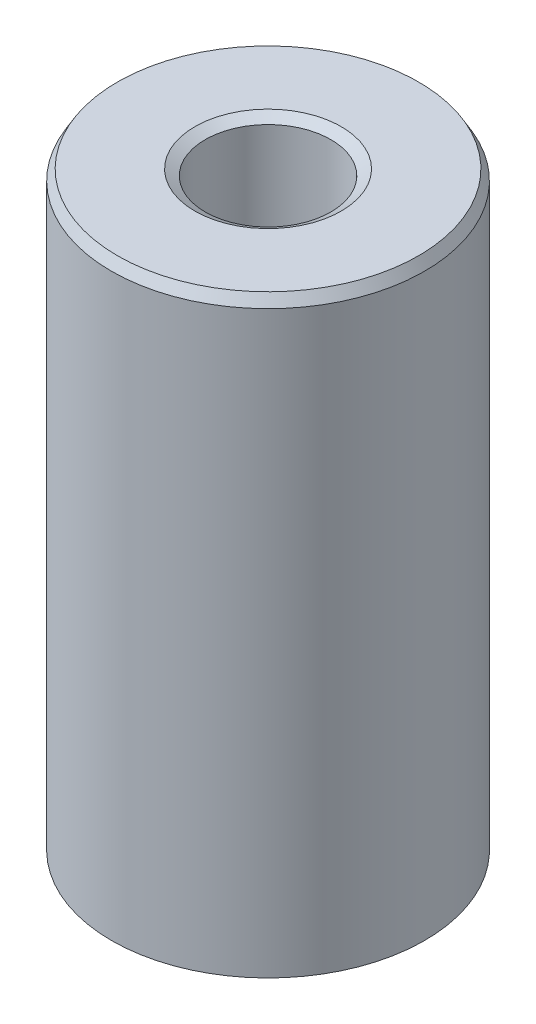
ISO-10303-21;
HEADER;
FILE_DESCRIPTION(('STEP AP214'),'2;1');
FILE_NAME('part.step','',(''),(''),'','','');
FILE_SCHEMA(('AUTOMOTIVE_DESIGN { 1 0 10303 214 1 1 1 1 }'));
ENDSEC;
DATA;
#1=APPLICATION_CONTEXT('core data for automotive mechanical design processes');
#2=APPLICATION_PROTOCOL_DEFINITION('international standard','automotive_design',2000,#1);
#3=PRODUCT_CONTEXT('',#1,'mechanical');
#4=PRODUCT('Part','Part','',(#3));
#5=PRODUCT_RELATED_PRODUCT_CATEGORY('part','',(#4));
#6=PRODUCT_DEFINITION_FORMATION('','',#4);
#7=PRODUCT_DEFINITION_CONTEXT('part definition',#1,'design');
#8=PRODUCT_DEFINITION('design','',#6,#7);
#9=PRODUCT_DEFINITION_SHAPE('','',#8);
#10=(LENGTH_UNIT() NAMED_UNIT(*) SI_UNIT(.MILLI.,.METRE.));
#11=(NAMED_UNIT(*) PLANE_ANGLE_UNIT() SI_UNIT($,.RADIAN.));
#12=(NAMED_UNIT(*) SI_UNIT($,.STERADIAN.) SOLID_ANGLE_UNIT());
#13=UNCERTAINTY_MEASURE_WITH_UNIT(LENGTH_MEASURE(1.E-05),#10,'distance_accuracy_value','');
#14=(GEOMETRIC_REPRESENTATION_CONTEXT(3) GLOBAL_UNCERTAINTY_ASSIGNED_CONTEXT((#13)) GLOBAL_UNIT_ASSIGNED_CONTEXT((#10,
#11,#12)) REPRESENTATION_CONTEXT('',''));
#15=CARTESIAN_POINT('',(0.,0.,0.));
#16=DIRECTION('',(0.,0.,1.));
#17=DIRECTION('',(1.,0.,0.));
#18=AXIS2_PLACEMENT_3D('',#15,#16,#17);
#19=CARTESIAN_POINT('',(0.,28.5536671741728,0.));
#20=DIRECTION('',(0.,-1.,0.));
#21=DIRECTION('',(0.,0.,-1.));
#22=AXIS2_PLACEMENT_3D('',#19,#20,#21);
#23=CYLINDRICAL_SURFACE('',#22,7.5);
#24=CARTESIAN_POINT('',(0.,0.287600365357656,0.));
#25=DIRECTION('',(0.,1.,0.));
#26=DIRECTION('',(0.,0.,1.));
#27=AXIS2_PLACEMENT_3D('',#24,#25,#26);
#28=CIRCLE('',#27,7.5);
#29=CARTESIAN_POINT('',(0.,0.287600365357656,7.5));
#30=VERTEX_POINT('',#29);
#31=EDGE_CURVE('E10',#30,#30,#28,.T.);
#32=ORIENTED_EDGE('',*,*,#31,.T.);
#33=EDGE_LOOP('',(#32));
#34=FACE_BOUND('',#33,.T.);
#35=CARTESIAN_POINT('',(0.,28.0555287290979,0.));
#36=DIRECTION('',(0.,1.,0.));
#37=DIRECTION('',(0.,0.,1.));
#38=AXIS2_PLACEMENT_3D('',#35,#36,#37);
#39=CIRCLE('',#38,7.5);
#40=CARTESIAN_POINT('',(0.,28.0555287290979,7.5));
#41=VERTEX_POINT('',#40);
#42=EDGE_CURVE('E50',#41,#41,#39,.F.);
#43=ORIENTED_EDGE('',*,*,#42,.T.);
#44=EDGE_LOOP('',(#43));
#45=FACE_BOUND('',#44,.T.);
#46=ADVANCED_FACE('F39',(#34,#45),#23,.T.);
#47=CARTESIAN_POINT('',(0.,28.5536671741728,0.));
#48=DIRECTION('',(0.,1.,0.));
#49=DIRECTION('',(0.,0.,1.));
#50=AXIS2_PLACEMENT_3D('',#47,#48,#49);
#51=PLANE('',#50);
#52=CARTESIAN_POINT('',(0.,28.5536671741728,0.));
#53=DIRECTION('',(0.,1.,0.));
#54=DIRECTION('',(0.,0.,1.));
#55=AXIS2_PLACEMENT_3D('',#52,#53,#54);
#56=CIRCLE('',#55,3.50622020351052);
#57=CARTESIAN_POINT('',(0.,28.5536671741728,3.50622020351052));
#58=VERTEX_POINT('',#57);
#59=EDGE_CURVE('E58',#58,#58,#56,.F.);
#60=ORIENTED_EDGE('',*,*,#59,.T.);
#61=EDGE_LOOP('',(#60));
#62=FACE_BOUND('',#61,.T.);
#63=CARTESIAN_POINT('',(0.,28.5536671741728,0.));
#64=DIRECTION('',(0.,1.,0.));
#65=DIRECTION('',(0.,0.,1.));
#66=AXIS2_PLACEMENT_3D('',#63,#64,#65);
#67=CIRCLE('',#66,7.21239963464234);
#68=CARTESIAN_POINT('',(0.,28.5536671741728,7.21239963464234));
#69=VERTEX_POINT('',#68);
#70=EDGE_CURVE('E61',#69,#69,#67,.T.);
#71=ORIENTED_EDGE('',*,*,#70,.T.);
#72=EDGE_LOOP('',(#71));
#73=FACE_BOUND('',#72,.T.);
#74=ADVANCED_FACE('F88',(#62,#73),#51,.T.);
#75=CARTESIAN_POINT('',(0.,0.,0.));
#76=DIRECTION('',(0.,1.,0.));
#77=DIRECTION('',(0.,0.,1.));
#78=AXIS2_PLACEMENT_3D('',#75,#76,#77);
#79=PLANE('',#78);
#80=CARTESIAN_POINT('',(0.,0.,0.));
#81=DIRECTION('',(0.,1.,0.));
#82=DIRECTION('',(0.,0.,1.));
#83=AXIS2_PLACEMENT_3D('',#80,#81,#82);
#84=CIRCLE('',#83,3.29568212379334);
#85=CARTESIAN_POINT('',(0.,0.,3.29568212379334));
#86=VERTEX_POINT('',#85);
#87=EDGE_CURVE('E51',#86,#86,#84,.T.);
#88=ORIENTED_EDGE('',*,*,#87,.T.);
#89=EDGE_LOOP('',(#88));
#90=FACE_BOUND('',#89,.T.);
#91=CARTESIAN_POINT('',(0.,0.,0.));
#92=DIRECTION('',(0.,1.,0.));
#93=DIRECTION('',(0.,0.,1.));
#94=AXIS2_PLACEMENT_3D('',#91,#92,#93);
#95=CIRCLE('',#94,7.00186155492516);
#96=CARTESIAN_POINT('',(0.,0.,7.00186155492516));
#97=VERTEX_POINT('',#96);
#98=EDGE_CURVE('E54',#97,#97,#95,.F.);
#99=ORIENTED_EDGE('',*,*,#98,.T.);
#100=EDGE_LOOP('',(#99));
#101=FACE_BOUND('',#100,.T.);
#102=ADVANCED_FACE('F83',(#90,#101),#79,.F.);
#103=CARTESIAN_POINT('',(0.,28.5536671741728,0.));
#104=DIRECTION('',(0.,-1.,0.));
#105=DIRECTION('',(0.,0.,-1.));
#106=AXIS2_PLACEMENT_3D('',#103,#104,#105);
#107=CYLINDRICAL_SURFACE('',#106,3.00808175843568);
#108=CARTESIAN_POINT('',(0.,28.2660668088151,0.));
#109=DIRECTION('',(0.,1.,0.));
#110=DIRECTION('',(0.,0.,1.));
#111=AXIS2_PLACEMENT_3D('',#108,#109,#110);
#112=CIRCLE('',#111,3.00808175843568);
#113=CARTESIAN_POINT('',(0.,28.2660668088151,3.00808175843568));
#114=VERTEX_POINT('',#113);
#115=EDGE_CURVE('E67',#114,#114,#112,.T.);
#116=ORIENTED_EDGE('',*,*,#115,.T.);
#117=EDGE_LOOP('',(#116));
#118=FACE_BOUND('',#117,.T.);
#119=CARTESIAN_POINT('',(0.,0.498138445074833,0.));
#120=DIRECTION('',(0.,1.,0.));
#121=DIRECTION('',(0.,0.,1.));
#122=AXIS2_PLACEMENT_3D('',#119,#120,#121);
#123=CIRCLE('',#122,3.00808175843568);
#124=CARTESIAN_POINT('',(0.,0.498138445074833,3.00808175843568));
#125=VERTEX_POINT('',#124);
#126=EDGE_CURVE('E69',#125,#125,#123,.F.);
#127=ORIENTED_EDGE('',*,*,#126,.T.);
#128=EDGE_LOOP('',(#127));
#129=FACE_BOUND('',#128,.T.);
#130=ADVANCED_FACE('F71',(#118,#129),#107,.F.);
#131=CARTESIAN_POINT('',(0.,28.2660668088151,0.));
#132=DIRECTION('',(0.,1.,0.));
#133=DIRECTION('',(0.,0.,1.));
#134=AXIS2_PLACEMENT_3D('',#131,#132,#133);
#135=CONICAL_SURFACE('',#134,3.00808175843568,1.04719755119661);
#136=ORIENTED_EDGE('',*,*,#59,.F.);
#137=EDGE_LOOP('',(#136));
#138=FACE_BOUND('',#137,.T.);
#139=ORIENTED_EDGE('',*,*,#115,.F.);
#140=EDGE_LOOP('',(#139));
#141=FACE_BOUND('',#140,.T.);
#142=ADVANCED_FACE('F77',(#138,#141),#135,.F.);
#143=CARTESIAN_POINT('',(0.,0.,0.));
#144=DIRECTION('',(0.,-1.,0.));
#145=DIRECTION('',(0.,0.,-1.));
#146=AXIS2_PLACEMENT_3D('',#143,#144,#145);
#147=CONICAL_SURFACE('',#146,3.29568212379334,0.523598775598296);
#148=ORIENTED_EDGE('',*,*,#126,.F.);
#149=EDGE_LOOP('',(#148));
#150=FACE_BOUND('',#149,.T.);
#151=ORIENTED_EDGE('',*,*,#87,.F.);
#152=EDGE_LOOP('',(#151));
#153=FACE_BOUND('',#152,.T.);
#154=ADVANCED_FACE('F73',(#150,#153),#147,.F.);
#155=CARTESIAN_POINT('',(0.,0.287600365357656,0.));
#156=DIRECTION('',(0.,1.,0.));
#157=DIRECTION('',(0.,0.,1.));
#158=AXIS2_PLACEMENT_3D('',#155,#156,#157);
#159=CONICAL_SURFACE('',#158,7.5,1.0471975511966);
#160=ORIENTED_EDGE('',*,*,#98,.F.);
#161=EDGE_LOOP('',(#160));
#162=FACE_BOUND('',#161,.T.);
#163=ORIENTED_EDGE('',*,*,#31,.F.);
#164=EDGE_LOOP('',(#163));
#165=FACE_BOUND('',#164,.T.);
#166=ADVANCED_FACE('F76',(#162,#165),#159,.T.);
#167=CARTESIAN_POINT('',(0.,28.5536671741728,0.));
#168=DIRECTION('',(0.,-1.,0.));
#169=DIRECTION('',(0.,0.,-1.));
#170=AXIS2_PLACEMENT_3D('',#167,#168,#169);
#171=CONICAL_SURFACE('',#170,7.21239963464234,0.523598775598301);
#172=ORIENTED_EDGE('',*,*,#42,.F.);
#173=EDGE_LOOP('',(#172));
#174=FACE_BOUND('',#173,.T.);
#175=ORIENTED_EDGE('',*,*,#70,.F.);
#176=EDGE_LOOP('',(#175));
#177=FACE_BOUND('',#176,.T.);
#178=ADVANCED_FACE('F45',(#174,#177),#171,.T.);
#179=CLOSED_SHELL('',(#46,#74,#102,#130,#142,#154,#166,#178));
#180=MANIFOLD_SOLID_BREP('B2',#179);
#181=ADVANCED_BREP_SHAPE_REPRESENTATION('',(#18,#180),#14);
#182=SHAPE_DEFINITION_REPRESENTATION(#9,#181);
ENDSEC;
END-ISO-10303-21;
